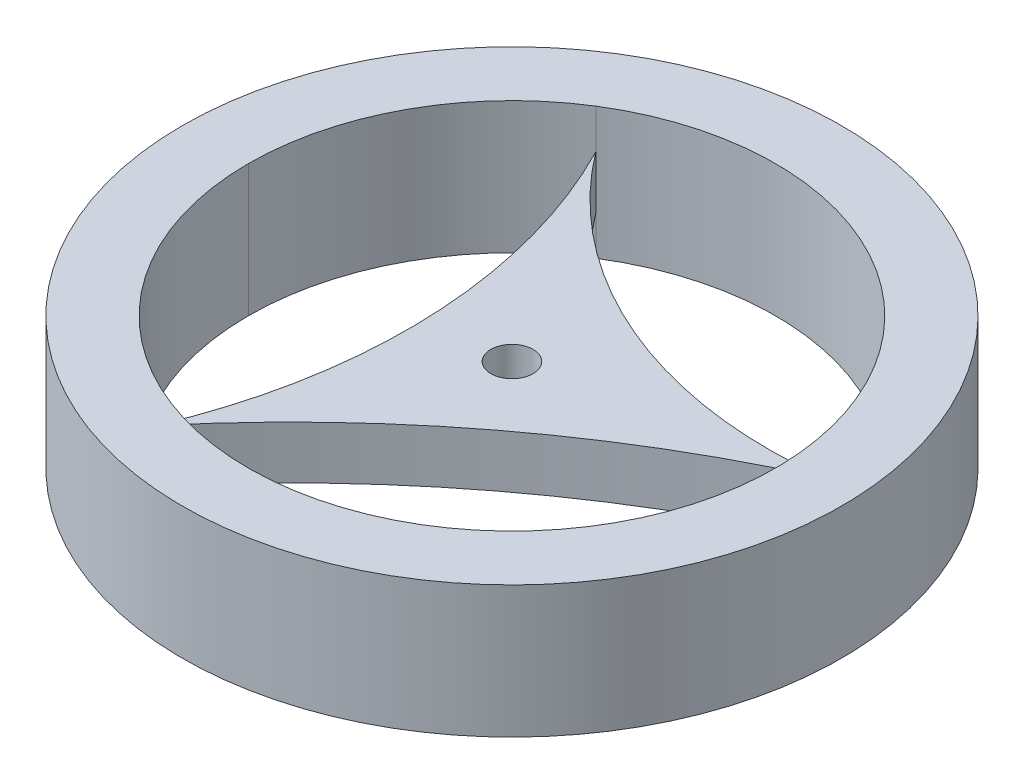
ISO-10303-21;
HEADER;
FILE_DESCRIPTION(('STEP AP214'),'2;1');
FILE_NAME('part.step','',(''),(''),'','','');
FILE_SCHEMA(('AUTOMOTIVE_DESIGN { 1 0 10303 214 1 1 1 1 }'));
ENDSEC;
DATA;
#1=APPLICATION_CONTEXT('core data for automotive mechanical design processes');
#2=APPLICATION_PROTOCOL_DEFINITION('international standard','automotive_design',2000,#1);
#3=PRODUCT_CONTEXT('',#1,'mechanical');
#4=PRODUCT('Part','Part','',(#3));
#5=PRODUCT_RELATED_PRODUCT_CATEGORY('part','',(#4));
#6=PRODUCT_DEFINITION_FORMATION('','',#4);
#7=PRODUCT_DEFINITION_CONTEXT('part definition',#1,'design');
#8=PRODUCT_DEFINITION('design','',#6,#7);
#9=PRODUCT_DEFINITION_SHAPE('','',#8);
#10=(LENGTH_UNIT() NAMED_UNIT(*) SI_UNIT(.MILLI.,.METRE.));
#11=(NAMED_UNIT(*) PLANE_ANGLE_UNIT() SI_UNIT($,.RADIAN.));
#12=(NAMED_UNIT(*) SI_UNIT($,.STERADIAN.) SOLID_ANGLE_UNIT());
#13=UNCERTAINTY_MEASURE_WITH_UNIT(LENGTH_MEASURE(1.E-05),#10,'distance_accuracy_value','');
#14=(GEOMETRIC_REPRESENTATION_CONTEXT(3) GLOBAL_UNCERTAINTY_ASSIGNED_CONTEXT((#13)) GLOBAL_UNIT_ASSIGNED_CONTEXT((#10,
#11,#12)) REPRESENTATION_CONTEXT('',''));
#15=CARTESIAN_POINT('',(0.,0.,0.));
#16=DIRECTION('',(0.,0.,1.));
#17=DIRECTION('',(1.,0.,0.));
#18=AXIS2_PLACEMENT_3D('',#15,#16,#17);
#19=CARTESIAN_POINT('',(72.5051961277329,-1.25,87.1782313820726));
#20=DIRECTION('',(0.,1.,0.));
#21=DIRECTION('',(1.,0.,0.));
#22=AXIS2_PLACEMENT_3D('',#19,#20,#21);
#23=CYLINDRICAL_SURFACE('',#22,101.463624697478);
#24=DIRECTION('',(0.,1.,0.));
#25=VECTOR('',#24,1.);
#26=CARTESIAN_POINT('',(-5.36888441490647,-1.25,22.1359780663303));
#27=LINE('',#26,#25);
#28=CARTESIAN_POINT('',(-5.36888441490647,-3.75,22.1359780663303));
#29=VERTEX_POINT('',#28);
#30=CARTESIAN_POINT('',(-5.36888441490647,1.25,22.1359780663303));
#31=VERTEX_POINT('',#30);
#32=EDGE_CURVE('P0_E74',#29,#31,#27,.T.);
#33=ORIENTED_EDGE('',*,*,#32,.F.);
#34=CARTESIAN_POINT('',(72.5051961277329,-3.75,87.1782313820726));
#35=DIRECTION('',(0.,1.,0.));
#36=DIRECTION('',(1.,0.,0.));
#37=AXIS2_PLACEMENT_3D('',#34,#35,#36);
#38=CIRCLE('',#37,101.463624697478);
#39=CARTESIAN_POINT('',(30.6887264358558,-3.75,-5.26769875689568));
#40=VERTEX_POINT('',#39);
#41=EDGE_CURVE('P0_E97',#40,#29,#38,.T.);
#42=ORIENTED_EDGE('',*,*,#41,.F.);
#43=DIRECTION('',(0.,-1.,0.));
#44=VECTOR('',#43,1.);
#45=CARTESIAN_POINT('',(30.6887264358558,-1.25,-5.26769875689571));
#46=LINE('',#45,#44);
#47=CARTESIAN_POINT('',(30.6887264358558,1.25,-5.26769875689568));
#48=VERTEX_POINT('',#47);
#49=EDGE_CURVE('P0_E25',#48,#40,#46,.T.);
#50=ORIENTED_EDGE('',*,*,#49,.F.);
#51=CARTESIAN_POINT('',(72.5051961277329,1.25,87.1782313820726));
#52=DIRECTION('',(0.,-1.,0.));
#53=DIRECTION('',(1.,0.,0.));
#54=AXIS2_PLACEMENT_3D('',#51,#52,#53);
#55=CIRCLE('',#54,101.463624697478);
#56=EDGE_CURVE('P0_E84',#31,#48,#55,.T.);
#57=ORIENTED_EDGE('',*,*,#56,.F.);
#58=EDGE_LOOP('',(#33,#42,#50,#57));
#59=FACE_BOUND('',#58,.T.);
#60=ADVANCED_FACE('P0_F16',(#59),#23,.F.);
#61=CARTESIAN_POINT('',(6.25,-1.25,0.));
#62=DIRECTION('',(0.,1.,0.));
#63=DIRECTION('',(1.,0.,0.));
#64=AXIS2_PLACEMENT_3D('',#61,#62,#63);
#65=CYLINDRICAL_SURFACE('',#64,2.);
#66=CARTESIAN_POINT('',(6.25,1.25,0.));
#67=DIRECTION('',(0.,-1.,0.));
#68=DIRECTION('',(1.,0.,0.));
#69=AXIS2_PLACEMENT_3D('',#66,#67,#68);
#70=CIRCLE('',#69,2.);
#71=CARTESIAN_POINT('',(4.25,1.25,0.));
#72=VERTEX_POINT('',#71);
#73=EDGE_CURVE('P0_E98',#72,#72,#70,.T.);
#74=ORIENTED_EDGE('',*,*,#73,.F.);
#75=DIRECTION('',(0.,-1.,0.));
#76=VECTOR('',#75,1.);
#77=CARTESIAN_POINT('',(4.25,-1.25,0.));
#78=LINE('',#77,#76);
#79=CARTESIAN_POINT('',(4.25,-3.75,0.));
#80=VERTEX_POINT('',#79);
#81=EDGE_CURVE('P0_E10',#72,#80,#78,.T.);
#82=ORIENTED_EDGE('',*,*,#81,.T.);
#83=CARTESIAN_POINT('',(6.25,-3.75,0.));
#84=DIRECTION('',(0.,1.,0.));
#85=DIRECTION('',(1.,0.,0.));
#86=AXIS2_PLACEMENT_3D('',#83,#84,#85);
#87=CIRCLE('',#86,2.);
#88=EDGE_CURVE('P0_E75',#80,#80,#87,.T.);
#89=ORIENTED_EDGE('',*,*,#88,.F.);
#90=ORIENTED_EDGE('',*,*,#81,.F.);
#91=EDGE_LOOP('',(#74,#82,#89,#90));
#92=FACE_BOUND('',#91,.T.);
#93=ADVANCED_FACE('P0_F120',(#92),#65,.F.);
#94=CARTESIAN_POINT('',(25.6443257363883,-1.25,-45.8784237897975));
#95=DIRECTION('',(0.,1.,0.));
#96=DIRECTION('',(1.,0.,0.));
#97=AXIS2_PLACEMENT_3D('',#94,#95,#96);
#98=CYLINDRICAL_SURFACE('',#97,40.922817182041);
#99=ORIENTED_EDGE('',*,*,#49,.T.);
#100=CARTESIAN_POINT('',(25.6443257363883,-3.75,-45.8784237897975));
#101=DIRECTION('',(0.,1.,0.));
#102=DIRECTION('',(1.,0.,0.));
#103=AXIS2_PLACEMENT_3D('',#100,#101,#102);
#104=CIRCLE('',#103,40.922817182041);
#105=CARTESIAN_POINT('',(-6.99997350007949,-3.75,-21.1999576001273));
#106=VERTEX_POINT('',#105);
#107=EDGE_CURVE('P0_E69',#106,#40,#104,.T.);
#108=ORIENTED_EDGE('',*,*,#107,.F.);
#109=DIRECTION('',(0.,1.,0.));
#110=VECTOR('',#109,1.);
#111=CARTESIAN_POINT('',(-6.99997350007947,0.,-21.1999576001272));
#112=LINE('',#111,#110);
#113=CARTESIAN_POINT('',(-6.99997350007949,1.25,-21.1999576001273));
#114=VERTEX_POINT('',#113);
#115=EDGE_CURVE('P0_E62',#106,#114,#112,.T.);
#116=ORIENTED_EDGE('',*,*,#115,.T.);
#117=CARTESIAN_POINT('',(25.6443257363883,1.25,-45.8784237897975));
#118=DIRECTION('',(0.,-1.,0.));
#119=DIRECTION('',(1.,0.,0.));
#120=AXIS2_PLACEMENT_3D('',#117,#118,#119);
#121=CIRCLE('',#120,40.922817182041);
#122=EDGE_CURVE('P0_E67',#48,#114,#121,.T.);
#123=ORIENTED_EDGE('',*,*,#122,.F.);
#124=EDGE_LOOP('',(#99,#108,#116,#123));
#125=FACE_BOUND('',#124,.T.);
#126=ADVANCED_FACE('P0_F65',(#125),#98,.F.);
#127=CARTESIAN_POINT('',(-52.3649973680889,-1.25,2.20616633664939));
#128=DIRECTION('',(0.,1.,0.));
#129=DIRECTION('',(1.,0.,0.));
#130=AXIS2_PLACEMENT_3D('',#127,#128,#129);
#131=CYLINDRICAL_SURFACE('',#130,51.0473508449637);
#132=ORIENTED_EDGE('',*,*,#115,.F.);
#133=CARTESIAN_POINT('',(-52.3649973680889,-3.75,2.20616633664939));
#134=DIRECTION('',(0.,1.,0.));
#135=DIRECTION('',(1.,0.,0.));
#136=AXIS2_PLACEMENT_3D('',#133,#134,#135);
#137=CIRCLE('',#136,51.0473508449637);
#138=EDGE_CURVE('P0_E102',#29,#106,#137,.T.);
#139=ORIENTED_EDGE('',*,*,#138,.F.);
#140=ORIENTED_EDGE('',*,*,#32,.T.);
#141=CARTESIAN_POINT('',(-52.3649973680889,1.25,2.20616633664939));
#142=DIRECTION('',(0.,-1.,0.));
#143=DIRECTION('',(1.,0.,0.));
#144=AXIS2_PLACEMENT_3D('',#141,#142,#143);
#145=CIRCLE('',#144,51.0473508449637);
#146=EDGE_CURVE('P0_E78',#114,#31,#145,.T.);
#147=ORIENTED_EDGE('',*,*,#146,.F.);
#148=EDGE_LOOP('',(#132,#139,#140,#147));
#149=FACE_BOUND('',#148,.T.);
#150=ADVANCED_FACE('P0_F79',(#149),#131,.F.);
#151=CARTESIAN_POINT('',(11.8443764678882,-3.75,0.468010233101524));
#152=DIRECTION('',(0.,1.,0.));
#153=DIRECTION('',(1.,0.,0.));
#154=AXIS2_PLACEMENT_3D('',#151,#152,#153);
#155=PLANE('',#154);
#156=ORIENTED_EDGE('',*,*,#88,.T.);
#157=EDGE_LOOP('',(#156));
#158=FACE_BOUND('',#157,.T.);
#159=ORIENTED_EDGE('',*,*,#107,.T.);
#160=ORIENTED_EDGE('',*,*,#41,.T.);
#161=ORIENTED_EDGE('',*,*,#138,.T.);
#162=EDGE_LOOP('',(#159,#160,#161));
#163=FACE_BOUND('',#162,.T.);
#164=ADVANCED_FACE('P0_F132',(#158,#163),#155,.F.);
#165=CARTESIAN_POINT('',(11.8443764678882,1.25,0.468010233101524));
#166=DIRECTION('',(0.,1.,0.));
#167=DIRECTION('',(1.,0.,0.));
#168=AXIS2_PLACEMENT_3D('',#165,#166,#167);
#169=PLANE('',#168);
#170=ORIENTED_EDGE('',*,*,#73,.T.);
#171=EDGE_LOOP('',(#170));
#172=FACE_BOUND('',#171,.T.);
#173=ORIENTED_EDGE('',*,*,#122,.T.);
#174=ORIENTED_EDGE('',*,*,#146,.T.);
#175=ORIENTED_EDGE('',*,*,#56,.T.);
#176=EDGE_LOOP('',(#173,#174,#175));
#177=FACE_BOUND('',#176,.T.);
#178=ADVANCED_FACE('P0_F86',(#172,#177),#169,.T.);
#179=CLOSED_SHELL('',(#60,#93,#126,#150,#164,#178));
#180=MANIFOLD_SOLID_BREP('P0_B1',#179);
#181=CARTESIAN_POINT('',(6.25,-7.5,0.));
#182=DIRECTION('',(0.,1.,0.));
#183=DIRECTION('',(1.,0.,0.));
#184=AXIS2_PLACEMENT_3D('',#181,#182,#183);
#185=PLANE('',#184);
#186=CARTESIAN_POINT('',(6.25,-7.5,0.));
#187=DIRECTION('',(0.,1.,0.));
#188=DIRECTION('',(1.,0.,0.));
#189=AXIS2_PLACEMENT_3D('',#186,#187,#188);
#190=CIRCLE('',#189,25.);
#191=CARTESIAN_POINT('',(-18.75,-7.5,0.));
#192=VERTEX_POINT('',#191);
#193=CARTESIAN_POINT('',(-6.99997350007945,-7.5,-21.1999576001272));
#194=VERTEX_POINT('',#193);
#195=EDGE_CURVE('P1_E68',#192,#194,#190,.T.);
#196=ORIENTED_EDGE('',*,*,#195,.T.);
#197=CARTESIAN_POINT('',(6.25,-7.5,0.));
#198=DIRECTION('',(0.,1.,0.));
#199=DIRECTION('',(1.,0.,0.));
#200=AXIS2_PLACEMENT_3D('',#197,#198,#199);
#201=CIRCLE('',#200,25.);
#202=EDGE_CURVE('P1_E89',#194,#192,#201,.T.);
#203=ORIENTED_EDGE('',*,*,#202,.T.);
#204=EDGE_LOOP('',(#196,#203));
#205=FACE_BOUND('',#204,.T.);
#206=CARTESIAN_POINT('',(6.25,-7.5,0.));
#207=DIRECTION('',(0.,-1.,0.));
#208=DIRECTION('',(1.,0.,0.));
#209=AXIS2_PLACEMENT_3D('',#206,#207,#208);
#210=CIRCLE('',#209,31.25);
#211=CARTESIAN_POINT('',(-25.,-7.5,0.));
#212=VERTEX_POINT('',#211);
#213=EDGE_CURVE('P1_E75',#212,#212,#210,.T.);
#214=ORIENTED_EDGE('',*,*,#213,.T.);
#215=EDGE_LOOP('',(#214));
#216=FACE_BOUND('',#215,.T.);
#217=ADVANCED_FACE('P1_F16',(#205,#216),#185,.F.);
#218=CARTESIAN_POINT('',(6.25,-1.25,0.));
#219=DIRECTION('',(0.,1.,0.));
#220=DIRECTION('',(0.529998940003178,0.,0.847998304005089));
#221=AXIS2_PLACEMENT_3D('',#218,#219,#220);
#222=CYLINDRICAL_SURFACE('',#221,25.);
#223=DIRECTION('',(0.,-1.,0.));
#224=VECTOR('',#223,1.);
#225=CARTESIAN_POINT('',(30.6887264358558,-1.25,-5.26769875689571));
#226=LINE('',#225,#224);
#227=CARTESIAN_POINT('',(30.6887264358558,1.25,-5.26769875689568));
#228=VERTEX_POINT('',#227);
#229=CARTESIAN_POINT('',(30.6887264358558,-3.75,-5.26769875689568));
#230=VERTEX_POINT('',#229);
#231=EDGE_CURVE('P1_E10',#228,#230,#226,.T.);
#232=ORIENTED_EDGE('',*,*,#231,.T.);
#233=ORIENTED_EDGE('',*,*,#231,.F.);
#234=EDGE_LOOP('',(#232,#233));
#235=FACE_BOUND('',#234,.T.);
#236=DIRECTION('',(0.,1.,0.));
#237=VECTOR('',#236,1.);
#238=CARTESIAN_POINT('',(-5.36888441490647,-1.25,22.1359780663303));
#239=LINE('',#238,#237);
#240=CARTESIAN_POINT('',(-5.36888441490647,-3.75,22.1359780663303));
#241=VERTEX_POINT('',#240);
#242=CARTESIAN_POINT('',(-5.36888441490647,1.25,22.1359780663303));
#243=VERTEX_POINT('',#242);
#244=EDGE_CURVE('P1_E27',#241,#243,#239,.T.);
#245=ORIENTED_EDGE('',*,*,#244,.T.);
#246=ORIENTED_EDGE('',*,*,#244,.F.);
#247=EDGE_LOOP('',(#245,#246));
#248=FACE_BOUND('',#247,.T.);
#249=DIRECTION('',(0.,-1.,0.));
#250=VECTOR('',#249,1.);
#251=CARTESIAN_POINT('',(-6.99997350007945,-1.25,-21.1999576001272));
#252=LINE('',#251,#250);
#253=CARTESIAN_POINT('',(-6.99997350007949,-3.75,-21.1999576001273));
#254=VERTEX_POINT('',#253);
#255=EDGE_CURVE('P1_E81',#254,#194,#252,.T.);
#256=ORIENTED_EDGE('',*,*,#255,.T.);
#257=ORIENTED_EDGE('',*,*,#195,.F.);
#258=DIRECTION('',(0.,-1.,0.));
#259=VECTOR('',#258,1.);
#260=CARTESIAN_POINT('',(-18.75,-1.25,0.));
#261=LINE('',#260,#259);
#262=CARTESIAN_POINT('',(-18.75,5.,0.));
#263=VERTEX_POINT('',#262);
#264=EDGE_CURVE('P1_E79',#263,#192,#261,.T.);
#265=ORIENTED_EDGE('',*,*,#264,.F.);
#266=CARTESIAN_POINT('',(6.25,5.,0.));
#267=DIRECTION('',(0.,-1.,0.));
#268=DIRECTION('',(1.,0.,0.));
#269=AXIS2_PLACEMENT_3D('',#266,#267,#268);
#270=CIRCLE('',#269,25.);
#271=CARTESIAN_POINT('',(-6.99997350007945,5.,-21.1999576001272));
#272=VERTEX_POINT('',#271);
#273=EDGE_CURVE('P1_E93',#272,#263,#270,.T.);
#274=ORIENTED_EDGE('',*,*,#273,.F.);
#275=DIRECTION('',(0.,-1.,0.));
#276=VECTOR('',#275,1.);
#277=CARTESIAN_POINT('',(-6.99997350007945,-1.25,-21.1999576001272));
#278=LINE('',#277,#276);
#279=CARTESIAN_POINT('',(-6.99997350007949,1.25,-21.1999576001273));
#280=VERTEX_POINT('',#279);
#281=EDGE_CURVE('P1_E102',#272,#280,#278,.T.);
#282=ORIENTED_EDGE('',*,*,#281,.T.);
#283=DIRECTION('',(0.,1.,0.));
#284=VECTOR('',#283,1.);
#285=CARTESIAN_POINT('',(-6.99997350007947,0.,-21.1999576001272));
#286=LINE('',#285,#284);
#287=EDGE_CURVE('P1_E85',#254,#280,#286,.T.);
#288=ORIENTED_EDGE('',*,*,#287,.F.);
#289=EDGE_LOOP('',(#256,#257,#265,#274,#282,#288));
#290=FACE_BOUND('',#289,.T.);
#291=ADVANCED_FACE('P1_F65',(#235,#248,#290),#222,.F.);
#292=CARTESIAN_POINT('',(6.25,-1.25,0.));
#293=DIRECTION('',(0.,1.,0.));
#294=DIRECTION('',(1.,0.,0.));
#295=AXIS2_PLACEMENT_3D('',#292,#293,#294);
#296=CYLINDRICAL_SURFACE('',#295,31.25);
#297=CARTESIAN_POINT('',(6.25,5.,0.));
#298=DIRECTION('',(0.,1.,0.));
#299=DIRECTION('',(1.,0.,0.));
#300=AXIS2_PLACEMENT_3D('',#297,#298,#299);
#301=CIRCLE('',#300,31.25);
#302=CARTESIAN_POINT('',(-25.,5.,0.));
#303=VERTEX_POINT('',#302);
#304=EDGE_CURVE('P1_E20',#303,#303,#301,.T.);
#305=ORIENTED_EDGE('',*,*,#304,.F.);
#306=DIRECTION('',(0.,-1.,0.));
#307=VECTOR('',#306,1.);
#308=CARTESIAN_POINT('',(-25.,-1.25,0.));
#309=LINE('',#308,#307);
#310=EDGE_CURVE('P1_E87',#303,#212,#309,.T.);
#311=ORIENTED_EDGE('',*,*,#310,.T.);
#312=ORIENTED_EDGE('',*,*,#213,.F.);
#313=ORIENTED_EDGE('',*,*,#310,.F.);
#314=EDGE_LOOP('',(#305,#311,#312,#313));
#315=FACE_BOUND('',#314,.T.);
#316=ADVANCED_FACE('P1_F18',(#315),#296,.T.);
#317=CARTESIAN_POINT('',(6.25,5.,0.));
#318=DIRECTION('',(0.,1.,0.));
#319=DIRECTION('',(1.,0.,0.));
#320=AXIS2_PLACEMENT_3D('',#317,#318,#319);
#321=PLANE('',#320);
#322=CARTESIAN_POINT('',(6.25,5.,0.));
#323=DIRECTION('',(0.,-1.,0.));
#324=DIRECTION('',(1.,0.,0.));
#325=AXIS2_PLACEMENT_3D('',#322,#323,#324);
#326=CIRCLE('',#325,25.);
#327=EDGE_CURVE('P1_E99',#263,#272,#326,.T.);
#328=ORIENTED_EDGE('',*,*,#327,.T.);
#329=ORIENTED_EDGE('',*,*,#273,.T.);
#330=EDGE_LOOP('',(#328,#329));
#331=FACE_BOUND('',#330,.T.);
#332=ORIENTED_EDGE('',*,*,#304,.T.);
#333=EDGE_LOOP('',(#332));
#334=FACE_BOUND('',#333,.T.);
#335=ADVANCED_FACE('P1_F139',(#331,#334),#321,.T.);
#336=CARTESIAN_POINT('',(6.25,-1.25,0.));
#337=DIRECTION('',(0.,1.,0.));
#338=DIRECTION('',(0.529998940003178,0.,0.847998304005089));
#339=AXIS2_PLACEMENT_3D('',#336,#337,#338);
#340=CYLINDRICAL_SURFACE('',#339,25.);
#341=ORIENTED_EDGE('',*,*,#255,.F.);
#342=ORIENTED_EDGE('',*,*,#287,.T.);
#343=ORIENTED_EDGE('',*,*,#281,.F.);
#344=ORIENTED_EDGE('',*,*,#327,.F.);
#345=ORIENTED_EDGE('',*,*,#264,.T.);
#346=ORIENTED_EDGE('',*,*,#202,.F.);
#347=EDGE_LOOP('',(#341,#342,#343,#344,#345,#346));
#348=FACE_BOUND('',#347,.T.);
#349=ADVANCED_FACE('P1_F120',(#348),#340,.F.);
#350=CLOSED_SHELL('',(#217,#291,#316,#335,#349));
#351=MANIFOLD_SOLID_BREP('P1_B1',#350);
#352=ADVANCED_BREP_SHAPE_REPRESENTATION('',(#18,#180,#351),#14);
#353=SHAPE_DEFINITION_REPRESENTATION(#9,#352);
ENDSEC;
END-ISO-10303-21;
